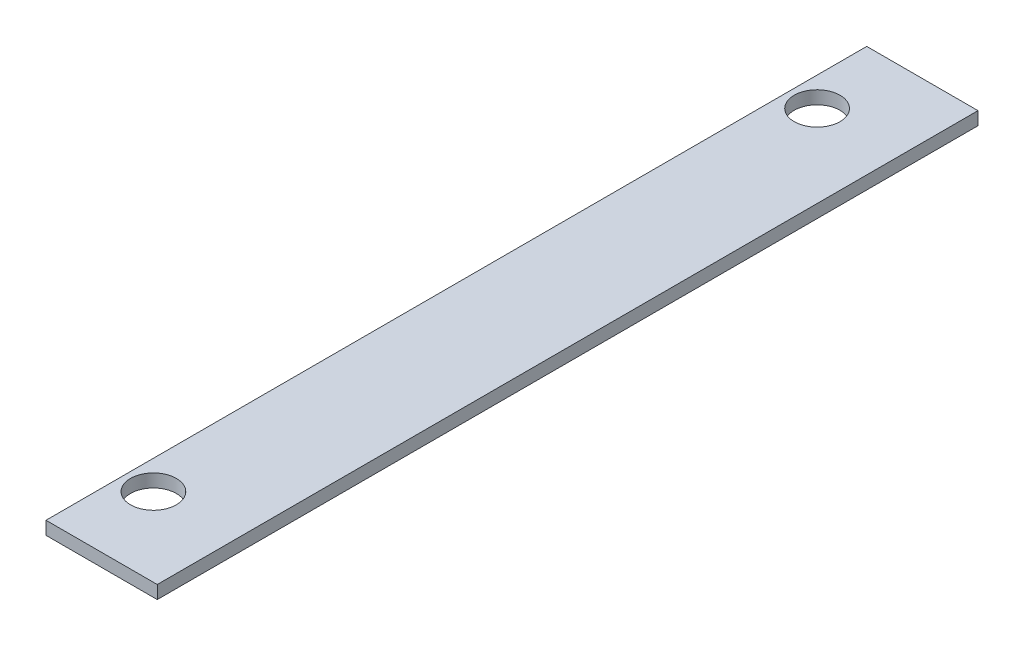
ISO-10303-21;
HEADER;
FILE_DESCRIPTION(('STEP AP214'),'2;1');
FILE_NAME('part.step','',(''),(''),'','','');
FILE_SCHEMA(('AUTOMOTIVE_DESIGN { 1 0 10303 214 1 1 1 1 }'));
ENDSEC;
DATA;
#1=APPLICATION_CONTEXT('core data for automotive mechanical design processes');
#2=APPLICATION_PROTOCOL_DEFINITION('international standard','automotive_design',2000,#1);
#3=PRODUCT_CONTEXT('',#1,'mechanical');
#4=PRODUCT('Part','Part','',(#3));
#5=PRODUCT_RELATED_PRODUCT_CATEGORY('part','',(#4));
#6=PRODUCT_DEFINITION_FORMATION('','',#4);
#7=PRODUCT_DEFINITION_CONTEXT('part definition',#1,'design');
#8=PRODUCT_DEFINITION('design','',#6,#7);
#9=PRODUCT_DEFINITION_SHAPE('','',#8);
#10=(LENGTH_UNIT() NAMED_UNIT(*) SI_UNIT(.MILLI.,.METRE.));
#11=(NAMED_UNIT(*) PLANE_ANGLE_UNIT() SI_UNIT($,.RADIAN.));
#12=(NAMED_UNIT(*) SI_UNIT($,.STERADIAN.) SOLID_ANGLE_UNIT());
#13=UNCERTAINTY_MEASURE_WITH_UNIT(LENGTH_MEASURE(1.E-05),#10,'distance_accuracy_value','');
#14=(GEOMETRIC_REPRESENTATION_CONTEXT(3) GLOBAL_UNCERTAINTY_ASSIGNED_CONTEXT((#13)) GLOBAL_UNIT_ASSIGNED_CONTEXT((#10,
#11,#12)) REPRESENTATION_CONTEXT('',''));
#15=CARTESIAN_POINT('',(0.,0.,0.));
#16=DIRECTION('',(0.,0.,1.));
#17=DIRECTION('',(1.,0.,0.));
#18=AXIS2_PLACEMENT_3D('',#15,#16,#17);
#19=CARTESIAN_POINT('',(135.,0.,197.705554788376));
#20=DIRECTION('',(1.,0.,0.));
#21=DIRECTION('',(0.,0.,1.00000000000001));
#22=AXIS2_PLACEMENT_3D('',#19,#20,#21);
#23=PLANE('',#22);
#24=DIRECTION('',(0.,1.,0.));
#25=VECTOR('',#24,1.);
#26=CARTESIAN_POINT('',(135.,0.,197.705554788376));
#27=LINE('',#26,#25);
#28=CARTESIAN_POINT('',(135.,-1.99999999999998,197.705554788376));
#29=VERTEX_POINT('',#28);
#30=CARTESIAN_POINT('',(135.,0.,197.705554788376));
#31=VERTEX_POINT('',#30);
#32=EDGE_CURVE('E11',#29,#31,#27,.T.);
#33=ORIENTED_EDGE('',*,*,#32,.F.);
#34=DIRECTION('',(0.,0.,1.));
#35=VECTOR('',#34,1.);
#36=CARTESIAN_POINT('',(135.,-1.99999999999998,2.09832151654394E-13));
#37=LINE('',#36,#35);
#38=CARTESIAN_POINT('',(135.,-1.99999999999998,72.2944452116268));
#39=VERTEX_POINT('',#38);
#40=EDGE_CURVE('E93',#39,#29,#37,.T.);
#41=ORIENTED_EDGE('',*,*,#40,.F.);
#42=DIRECTION('',(0.,1.,0.));
#43=VECTOR('',#42,1.);
#44=CARTESIAN_POINT('',(135.,-1.66533453693773E-13,72.2944452116268));
#45=LINE('',#44,#43);
#46=CARTESIAN_POINT('',(135.,-1.66533453693773E-13,72.2944452116268));
#47=VERTEX_POINT('',#46);
#48=EDGE_CURVE('E47',#39,#47,#45,.T.);
#49=ORIENTED_EDGE('',*,*,#48,.T.);
#50=DIRECTION('',(0.,0.,1.00000000000001));
#51=VECTOR('',#50,1.);
#52=CARTESIAN_POINT('',(135.,0.,197.705554788376));
#53=LINE('',#52,#51);
#54=EDGE_CURVE('E112',#47,#31,#53,.T.);
#55=ORIENTED_EDGE('',*,*,#54,.T.);
#56=EDGE_LOOP('',(#33,#41,#49,#55));
#57=FACE_BOUND('',#56,.T.);
#58=ADVANCED_FACE('F37',(#57),#23,.T.);
#59=CARTESIAN_POINT('',(118.,0.,72.294445211627));
#60=DIRECTION('',(0.,0.,-1.));
#61=DIRECTION('',(1.,0.,0.));
#62=AXIS2_PLACEMENT_3D('',#59,#60,#61);
#63=PLANE('',#62);
#64=ORIENTED_EDGE('',*,*,#48,.F.);
#65=DIRECTION('',(1.,0.,0.));
#66=VECTOR('',#65,1.);
#67=CARTESIAN_POINT('',(-1.12000746637413E-13,-2.,72.2944452116268));
#68=LINE('',#67,#66);
#69=CARTESIAN_POINT('',(118.,-1.99999999999998,72.294445211627));
#70=VERTEX_POINT('',#69);
#71=EDGE_CURVE('E100',#70,#39,#68,.T.);
#72=ORIENTED_EDGE('',*,*,#71,.F.);
#73=DIRECTION('',(0.,1.,0.));
#74=VECTOR('',#73,1.);
#75=CARTESIAN_POINT('',(118.,0.,72.294445211627));
#76=LINE('',#75,#74);
#77=CARTESIAN_POINT('',(118.,0.,72.294445211627));
#78=VERTEX_POINT('',#77);
#79=EDGE_CURVE('E55',#70,#78,#76,.T.);
#80=ORIENTED_EDGE('',*,*,#79,.T.);
#81=DIRECTION('',(1.,0.,0.));
#82=VECTOR('',#81,1.);
#83=CARTESIAN_POINT('',(118.,0.,72.294445211627));
#84=LINE('',#83,#82);
#85=EDGE_CURVE('E117',#78,#47,#84,.T.);
#86=ORIENTED_EDGE('',*,*,#85,.T.);
#87=EDGE_LOOP('',(#64,#72,#80,#86));
#88=FACE_BOUND('',#87,.T.);
#89=ADVANCED_FACE('F119',(#88),#63,.T.);
#90=CARTESIAN_POINT('',(118.,0.,197.705554788376));
#91=DIRECTION('',(-1.,0.,0.));
#92=DIRECTION('',(0.,0.,-1.00000000000001));
#93=AXIS2_PLACEMENT_3D('',#90,#91,#92);
#94=PLANE('',#93);
#95=ORIENTED_EDGE('',*,*,#79,.F.);
#96=DIRECTION('',(0.,0.,1.));
#97=VECTOR('',#96,1.);
#98=CARTESIAN_POINT('',(118.,-1.99999999999998,1.83408843668285E-13));
#99=LINE('',#98,#97);
#100=CARTESIAN_POINT('',(118.,-1.99999999999998,197.705554788376));
#101=VERTEX_POINT('',#100);
#102=EDGE_CURVE('E92',#101,#70,#99,.F.);
#103=ORIENTED_EDGE('',*,*,#102,.F.);
#104=DIRECTION('',(0.,1.,0.));
#105=VECTOR('',#104,1.);
#106=CARTESIAN_POINT('',(118.,0.,197.705554788376));
#107=LINE('',#106,#105);
#108=CARTESIAN_POINT('',(118.,0.,197.705554788376));
#109=VERTEX_POINT('',#108);
#110=EDGE_CURVE('E41',#101,#109,#107,.T.);
#111=ORIENTED_EDGE('',*,*,#110,.T.);
#112=DIRECTION('',(0.,0.,-1.00000000000001));
#113=VECTOR('',#112,1.);
#114=CARTESIAN_POINT('',(118.,0.,197.705554788376));
#115=LINE('',#114,#113);
#116=EDGE_CURVE('E109',#109,#78,#115,.T.);
#117=ORIENTED_EDGE('',*,*,#116,.T.);
#118=EDGE_LOOP('',(#95,#103,#111,#117));
#119=FACE_BOUND('',#118,.T.);
#120=ADVANCED_FACE('F95',(#119),#94,.T.);
#121=CARTESIAN_POINT('',(118.,0.,197.705554788376));
#122=DIRECTION('',(0.,0.,1.));
#123=DIRECTION('',(-1.,0.,0.));
#124=AXIS2_PLACEMENT_3D('',#121,#122,#123);
#125=PLANE('',#124);
#126=DIRECTION('',(1.,0.,0.));
#127=VECTOR('',#126,1.);
#128=CARTESIAN_POINT('',(-3.06928768591888E-13,-2.,197.705554788375));
#129=LINE('',#128,#127);
#130=EDGE_CURVE('E80',#29,#101,#129,.F.);
#131=ORIENTED_EDGE('',*,*,#130,.F.);
#132=ORIENTED_EDGE('',*,*,#32,.T.);
#133=DIRECTION('',(-1.,0.,0.));
#134=VECTOR('',#133,1.);
#135=CARTESIAN_POINT('',(118.,0.,197.705554788376));
#136=LINE('',#135,#134);
#137=EDGE_CURVE('E82',#31,#109,#136,.T.);
#138=ORIENTED_EDGE('',*,*,#137,.T.);
#139=ORIENTED_EDGE('',*,*,#110,.F.);
#140=EDGE_LOOP('',(#131,#132,#138,#139));
#141=FACE_BOUND('',#140,.T.);
#142=ADVANCED_FACE('F79',(#141),#125,.T.);
#143=CARTESIAN_POINT('',(122.414038057746,0.,185.705554788376));
#144=DIRECTION('',(0.,-1.,0.));
#145=DIRECTION('',(1.,0.,0.));
#146=AXIS2_PLACEMENT_3D('',#143,#144,#145);
#147=CYLINDRICAL_SURFACE('',#146,3.49999999999999);
#148=CARTESIAN_POINT('',(122.414038057746,0.,185.705554788376));
#149=DIRECTION('',(0.,-1.,0.));
#150=DIRECTION('',(1.,0.,0.));
#151=AXIS2_PLACEMENT_3D('',#148,#149,#150);
#152=CIRCLE('',#151,3.49999999999999);
#153=CARTESIAN_POINT('',(125.914038057746,0.,185.705554788376));
#154=VERTEX_POINT('',#153);
#155=EDGE_CURVE('E120',#154,#154,#152,.T.);
#156=ORIENTED_EDGE('',*,*,#155,.F.);
#157=EDGE_LOOP('',(#156));
#158=FACE_BOUND('',#157,.T.);
#159=CARTESIAN_POINT('',(122.414038057746,-1.99999999999999,185.705554788376));
#160=DIRECTION('',(0.,-1.,0.));
#161=DIRECTION('',(1.,0.,0.));
#162=AXIS2_PLACEMENT_3D('',#159,#160,#161);
#163=CIRCLE('',#162,3.49999999999999);
#164=CARTESIAN_POINT('',(125.914038057746,-1.99999999999999,185.705554788376));
#165=VERTEX_POINT('',#164);
#166=EDGE_CURVE('E102',#165,#165,#163,.T.);
#167=ORIENTED_EDGE('',*,*,#166,.T.);
#168=EDGE_LOOP('',(#167));
#169=FACE_BOUND('',#168,.T.);
#170=ADVANCED_FACE('F133',(#158,#169),#147,.F.);
#171=CARTESIAN_POINT('',(122.414038057746,0.,84.2944452116268));
#172=DIRECTION('',(0.,-1.,0.));
#173=DIRECTION('',(1.,0.,0.));
#174=AXIS2_PLACEMENT_3D('',#171,#172,#173);
#175=CYLINDRICAL_SURFACE('',#174,3.49999999999998);
#176=CARTESIAN_POINT('',(122.414038057746,0.,84.2944452116268));
#177=DIRECTION('',(0.,-1.,0.));
#178=DIRECTION('',(1.,0.,0.));
#179=AXIS2_PLACEMENT_3D('',#176,#177,#178);
#180=CIRCLE('',#179,3.49999999999998);
#181=CARTESIAN_POINT('',(125.914038057746,0.,84.2944452116268));
#182=VERTEX_POINT('',#181);
#183=EDGE_CURVE('E86',#182,#182,#180,.T.);
#184=ORIENTED_EDGE('',*,*,#183,.F.);
#185=EDGE_LOOP('',(#184));
#186=FACE_BOUND('',#185,.T.);
#187=CARTESIAN_POINT('',(122.414038057746,-1.99999999999997,84.2944452116268));
#188=DIRECTION('',(0.,-1.,0.));
#189=DIRECTION('',(1.,0.,0.));
#190=AXIS2_PLACEMENT_3D('',#187,#188,#189);
#191=CIRCLE('',#190,3.49999999999998);
#192=CARTESIAN_POINT('',(125.914038057746,-1.99999999999997,84.2944452116268));
#193=VERTEX_POINT('',#192);
#194=EDGE_CURVE('E106',#193,#193,#191,.T.);
#195=ORIENTED_EDGE('',*,*,#194,.T.);
#196=EDGE_LOOP('',(#195));
#197=FACE_BOUND('',#196,.T.);
#198=ADVANCED_FACE('F39',(#186,#197),#175,.F.);
#199=CARTESIAN_POINT('',(0.,0.,0.));
#200=DIRECTION('',(0.,-1.,0.));
#201=DIRECTION('',(1.,0.,0.));
#202=AXIS2_PLACEMENT_3D('',#199,#200,#201);
#203=PLANE('',#202);
#204=ORIENTED_EDGE('',*,*,#116,.F.);
#205=ORIENTED_EDGE('',*,*,#137,.F.);
#206=ORIENTED_EDGE('',*,*,#54,.F.);
#207=ORIENTED_EDGE('',*,*,#85,.F.);
#208=EDGE_LOOP('',(#204,#205,#206,#207));
#209=FACE_BOUND('',#208,.T.);
#210=ORIENTED_EDGE('',*,*,#155,.T.);
#211=EDGE_LOOP('',(#210));
#212=FACE_BOUND('',#211,.T.);
#213=ORIENTED_EDGE('',*,*,#183,.T.);
#214=EDGE_LOOP('',(#213));
#215=FACE_BOUND('',#214,.T.);
#216=ADVANCED_FACE('F115',(#209,#212,#215),#203,.F.);
#217=CARTESIAN_POINT('',(0.,-2.,0.));
#218=DIRECTION('',(0.,-1.,0.));
#219=DIRECTION('',(1.,0.,0.));
#220=AXIS2_PLACEMENT_3D('',#217,#218,#219);
#221=PLANE('',#220);
#222=ORIENTED_EDGE('',*,*,#102,.T.);
#223=ORIENTED_EDGE('',*,*,#71,.T.);
#224=ORIENTED_EDGE('',*,*,#40,.T.);
#225=ORIENTED_EDGE('',*,*,#130,.T.);
#226=EDGE_LOOP('',(#222,#223,#224,#225));
#227=FACE_BOUND('',#226,.T.);
#228=ORIENTED_EDGE('',*,*,#166,.F.);
#229=EDGE_LOOP('',(#228));
#230=FACE_BOUND('',#229,.T.);
#231=ORIENTED_EDGE('',*,*,#194,.F.);
#232=EDGE_LOOP('',(#231));
#233=FACE_BOUND('',#232,.T.);
#234=ADVANCED_FACE('F89',(#227,#230,#233),#221,.T.);
#235=CLOSED_SHELL('',(#58,#89,#120,#142,#170,#198,#216,#234));
#236=MANIFOLD_SOLID_BREP('B2',#235);
#237=ADVANCED_BREP_SHAPE_REPRESENTATION('',(#18,#236),#14);
#238=SHAPE_DEFINITION_REPRESENTATION(#9,#237);
ENDSEC;
END-ISO-10303-21;
